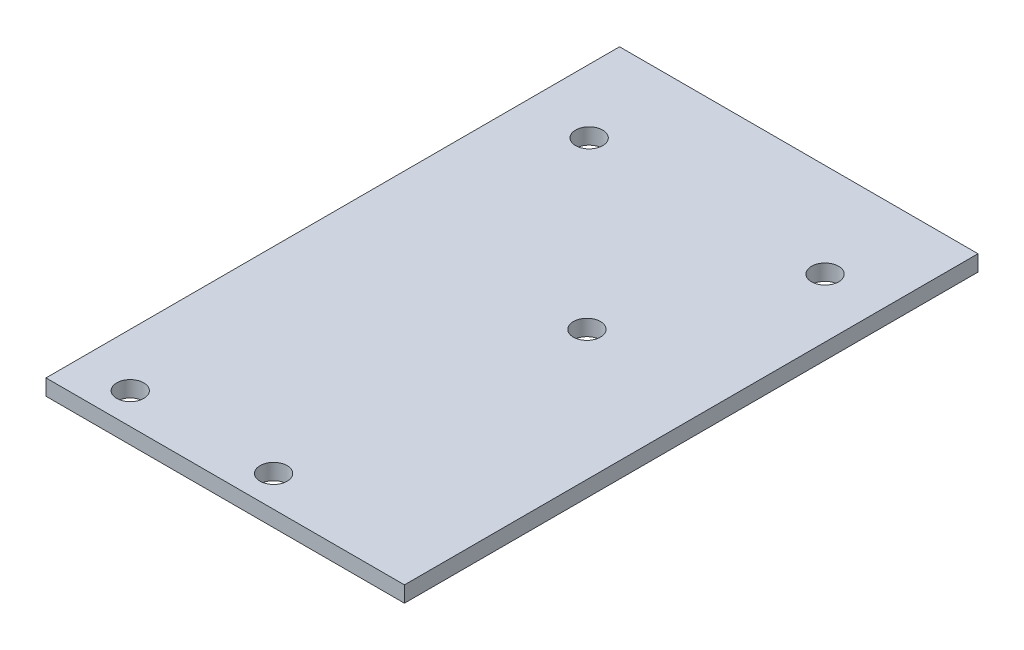
ISO-10303-21;
HEADER;
FILE_DESCRIPTION(('STEP AP214'),'2;1');
FILE_NAME('part.step','',(''),(''),'','','');
FILE_SCHEMA(('AUTOMOTIVE_DESIGN { 1 0 10303 214 1 1 1 1 }'));
ENDSEC;
DATA;
#1=APPLICATION_CONTEXT('core data for automotive mechanical design processes');
#2=APPLICATION_PROTOCOL_DEFINITION('international standard','automotive_design',2000,#1);
#3=PRODUCT_CONTEXT('',#1,'mechanical');
#4=PRODUCT('Part','Part','',(#3));
#5=PRODUCT_RELATED_PRODUCT_CATEGORY('part','',(#4));
#6=PRODUCT_DEFINITION_FORMATION('','',#4);
#7=PRODUCT_DEFINITION_CONTEXT('part definition',#1,'design');
#8=PRODUCT_DEFINITION('design','',#6,#7);
#9=PRODUCT_DEFINITION_SHAPE('','',#8);
#10=(LENGTH_UNIT() NAMED_UNIT(*) SI_UNIT(.MILLI.,.METRE.));
#11=(NAMED_UNIT(*) PLANE_ANGLE_UNIT() SI_UNIT($,.RADIAN.));
#12=(NAMED_UNIT(*) SI_UNIT($,.STERADIAN.) SOLID_ANGLE_UNIT());
#13=UNCERTAINTY_MEASURE_WITH_UNIT(LENGTH_MEASURE(1.E-05),#10,'distance_accuracy_value','');
#14=(GEOMETRIC_REPRESENTATION_CONTEXT(3) GLOBAL_UNCERTAINTY_ASSIGNED_CONTEXT((#13)) GLOBAL_UNIT_ASSIGNED_CONTEXT((#10,
#11,#12)) REPRESENTATION_CONTEXT('',''));
#15=CARTESIAN_POINT('',(0.,0.,0.));
#16=DIRECTION('',(0.,0.,1.));
#17=DIRECTION('',(1.,0.,0.));
#18=AXIS2_PLACEMENT_3D('',#15,#16,#17);
#19=CARTESIAN_POINT('',(-22.5,-2.,36.));
#20=DIRECTION('',(-1.,0.,0.));
#21=DIRECTION('',(0.,0.,1.));
#22=AXIS2_PLACEMENT_3D('',#19,#20,#21);
#23=PLANE('',#22);
#24=DIRECTION('',(0.,0.,1.));
#25=VECTOR('',#24,1.);
#26=CARTESIAN_POINT('',(-22.5,0.,36.));
#27=LINE('',#26,#25);
#28=CARTESIAN_POINT('',(-22.5,0.,-36.));
#29=VERTEX_POINT('',#28);
#30=CARTESIAN_POINT('',(-22.5,0.,36.));
#31=VERTEX_POINT('',#30);
#32=EDGE_CURVE('E104',#29,#31,#27,.T.);
#33=ORIENTED_EDGE('',*,*,#32,.F.);
#34=DIRECTION('',(0.,1.,0.));
#35=VECTOR('',#34,1.);
#36=CARTESIAN_POINT('',(-22.5,-2.,-36.));
#37=LINE('',#36,#35);
#38=CARTESIAN_POINT('',(-22.5,-2.,-36.));
#39=VERTEX_POINT('',#38);
#40=EDGE_CURVE('E11',#39,#29,#37,.T.);
#41=ORIENTED_EDGE('',*,*,#40,.F.);
#42=DIRECTION('',(0.,0.,1.));
#43=VECTOR('',#42,1.);
#44=CARTESIAN_POINT('',(-22.5,-2.,36.));
#45=LINE('',#44,#43);
#46=CARTESIAN_POINT('',(-22.5,-2.,36.));
#47=VERTEX_POINT('',#46);
#48=EDGE_CURVE('E97',#39,#47,#45,.T.);
#49=ORIENTED_EDGE('',*,*,#48,.T.);
#50=DIRECTION('',(0.,1.,0.));
#51=VECTOR('',#50,1.);
#52=CARTESIAN_POINT('',(-22.5,-2.,36.));
#53=LINE('',#52,#51);
#54=EDGE_CURVE('E80',#47,#31,#53,.T.);
#55=ORIENTED_EDGE('',*,*,#54,.T.);
#56=EDGE_LOOP('',(#33,#41,#49,#55));
#57=FACE_BOUND('',#56,.T.);
#58=ADVANCED_FACE('F37',(#57),#23,.T.);
#59=CARTESIAN_POINT('',(22.5,-2.,-36.));
#60=DIRECTION('',(0.,0.,-1.));
#61=DIRECTION('',(-1.,0.,0.));
#62=AXIS2_PLACEMENT_3D('',#59,#60,#61);
#63=PLANE('',#62);
#64=DIRECTION('',(-1.,0.,0.));
#65=VECTOR('',#64,1.);
#66=CARTESIAN_POINT('',(22.5,0.,-36.));
#67=LINE('',#66,#65);
#68=CARTESIAN_POINT('',(22.5,0.,-36.));
#69=VERTEX_POINT('',#68);
#70=EDGE_CURVE('E99',#69,#29,#67,.T.);
#71=ORIENTED_EDGE('',*,*,#70,.F.);
#72=DIRECTION('',(0.,1.,0.));
#73=VECTOR('',#72,1.);
#74=CARTESIAN_POINT('',(22.5,-2.,-36.));
#75=LINE('',#74,#73);
#76=CARTESIAN_POINT('',(22.5,-2.,-36.));
#77=VERTEX_POINT('',#76);
#78=EDGE_CURVE('E46',#77,#69,#75,.T.);
#79=ORIENTED_EDGE('',*,*,#78,.F.);
#80=DIRECTION('',(-1.,0.,0.));
#81=VECTOR('',#80,1.);
#82=CARTESIAN_POINT('',(22.5,-2.,-36.));
#83=LINE('',#82,#81);
#84=EDGE_CURVE('E94',#77,#39,#83,.T.);
#85=ORIENTED_EDGE('',*,*,#84,.T.);
#86=ORIENTED_EDGE('',*,*,#40,.T.);
#87=EDGE_LOOP('',(#71,#79,#85,#86));
#88=FACE_BOUND('',#87,.T.);
#89=ADVANCED_FACE('F148',(#88),#63,.T.);
#90=CARTESIAN_POINT('',(22.5,-2.,36.));
#91=DIRECTION('',(1.,0.,0.));
#92=DIRECTION('',(0.,0.,-1.));
#93=AXIS2_PLACEMENT_3D('',#90,#91,#92);
#94=PLANE('',#93);
#95=DIRECTION('',(0.,0.,-1.));
#96=VECTOR('',#95,1.);
#97=CARTESIAN_POINT('',(22.5,0.,36.));
#98=LINE('',#97,#96);
#99=CARTESIAN_POINT('',(22.5,0.,36.));
#100=VERTEX_POINT('',#99);
#101=EDGE_CURVE('E88',#100,#69,#98,.T.);
#102=ORIENTED_EDGE('',*,*,#101,.F.);
#103=DIRECTION('',(0.,1.,0.));
#104=VECTOR('',#103,1.);
#105=CARTESIAN_POINT('',(22.5,-2.,36.));
#106=LINE('',#105,#104);
#107=CARTESIAN_POINT('',(22.5,-2.,36.));
#108=VERTEX_POINT('',#107);
#109=EDGE_CURVE('E83',#108,#100,#106,.T.);
#110=ORIENTED_EDGE('',*,*,#109,.F.);
#111=DIRECTION('',(0.,0.,-1.));
#112=VECTOR('',#111,1.);
#113=CARTESIAN_POINT('',(22.5,-2.,36.));
#114=LINE('',#113,#112);
#115=EDGE_CURVE('E86',#108,#77,#114,.T.);
#116=ORIENTED_EDGE('',*,*,#115,.T.);
#117=ORIENTED_EDGE('',*,*,#78,.T.);
#118=EDGE_LOOP('',(#102,#110,#116,#117));
#119=FACE_BOUND('',#118,.T.);
#120=ADVANCED_FACE('F85',(#119),#94,.T.);
#121=CARTESIAN_POINT('',(22.5,-2.,36.));
#122=DIRECTION('',(0.,0.,1.));
#123=DIRECTION('',(1.,0.,0.));
#124=AXIS2_PLACEMENT_3D('',#121,#122,#123);
#125=PLANE('',#124);
#126=DIRECTION('',(1.,0.,0.));
#127=VECTOR('',#126,1.);
#128=CARTESIAN_POINT('',(22.5,0.,36.));
#129=LINE('',#128,#127);
#130=EDGE_CURVE('E107',#31,#100,#129,.T.);
#131=ORIENTED_EDGE('',*,*,#130,.F.);
#132=ORIENTED_EDGE('',*,*,#54,.F.);
#133=DIRECTION('',(1.,0.,0.));
#134=VECTOR('',#133,1.);
#135=CARTESIAN_POINT('',(22.5,-2.,36.));
#136=LINE('',#135,#134);
#137=EDGE_CURVE('E93',#47,#108,#136,.T.);
#138=ORIENTED_EDGE('',*,*,#137,.T.);
#139=ORIENTED_EDGE('',*,*,#109,.T.);
#140=EDGE_LOOP('',(#131,#132,#138,#139));
#141=FACE_BOUND('',#140,.T.);
#142=ADVANCED_FACE('F96',(#141),#125,.T.);
#143=CARTESIAN_POINT('',(0.,-2.,0.));
#144=DIRECTION('',(0.,1.,0.));
#145=DIRECTION('',(0.,0.,1.));
#146=AXIS2_PLACEMENT_3D('',#143,#144,#145);
#147=PLANE('',#146);
#148=CARTESIAN_POINT('',(2.17232157779291,-2.,32.098));
#149=DIRECTION('',(0.,-1.,0.));
#150=DIRECTION('',(0.,0.,-1.));
#151=AXIS2_PLACEMENT_3D('',#148,#149,#150);
#152=CIRCLE('',#151,1.69999999999999);
#153=CARTESIAN_POINT('',(2.17232157779291,-2.,30.398));
#154=VERTEX_POINT('',#153);
#155=EDGE_CURVE('E189',#154,#154,#152,.T.);
#156=ORIENTED_EDGE('',*,*,#155,.F.);
#157=EDGE_LOOP('',(#156));
#158=FACE_BOUND('',#157,.T.);
#159=CARTESIAN_POINT('',(-15.8276784222071,-2.,32.098));
#160=DIRECTION('',(0.,-1.,0.));
#161=DIRECTION('',(0.,0.,-1.));
#162=AXIS2_PLACEMENT_3D('',#159,#160,#161);
#163=CIRCLE('',#162,1.69999999999999);
#164=CARTESIAN_POINT('',(-15.8276784222071,-2.,30.398));
#165=VERTEX_POINT('',#164);
#166=EDGE_CURVE('E132',#165,#165,#163,.T.);
#167=ORIENTED_EDGE('',*,*,#166,.F.);
#168=EDGE_LOOP('',(#167));
#169=FACE_BOUND('',#168,.T.);
#170=CARTESIAN_POINT('',(6.1723215777929,-2.,-3.23000000000001));
#171=DIRECTION('',(0.,-1.,0.));
#172=DIRECTION('',(0.,0.,-1.));
#173=AXIS2_PLACEMENT_3D('',#170,#171,#172);
#174=CIRCLE('',#173,1.69999999999999);
#175=CARTESIAN_POINT('',(6.1723215777929,-2.,-4.93));
#176=VERTEX_POINT('',#175);
#177=EDGE_CURVE('E121',#176,#176,#174,.T.);
#178=ORIENTED_EDGE('',*,*,#177,.F.);
#179=EDGE_LOOP('',(#178));
#180=FACE_BOUND('',#179,.T.);
#181=CARTESIAN_POINT('',(15.1096317147363,-2.,-24.190770957464));
#182=DIRECTION('',(0.,-1.,0.));
#183=DIRECTION('',(0.,0.,-1.));
#184=AXIS2_PLACEMENT_3D('',#181,#182,#183);
#185=CIRCLE('',#184,1.69999999999999);
#186=CARTESIAN_POINT('',(15.1096317147363,-2.,-25.890770957464));
#187=VERTEX_POINT('',#186);
#188=EDGE_CURVE('E118',#187,#187,#185,.T.);
#189=ORIENTED_EDGE('',*,*,#188,.F.);
#190=EDGE_LOOP('',(#189));
#191=FACE_BOUND('',#190,.T.);
#192=CARTESIAN_POINT('',(-14.5043161446878,-2.,-24.190770957464));
#193=DIRECTION('',(0.,-1.,0.));
#194=DIRECTION('',(0.,0.,-1.));
#195=AXIS2_PLACEMENT_3D('',#192,#193,#194);
#196=CIRCLE('',#195,1.69999999999999);
#197=CARTESIAN_POINT('',(-14.5043161446878,-2.,-25.890770957464));
#198=VERTEX_POINT('',#197);
#199=EDGE_CURVE('E117',#198,#198,#196,.T.);
#200=ORIENTED_EDGE('',*,*,#199,.F.);
#201=EDGE_LOOP('',(#200));
#202=FACE_BOUND('',#201,.T.);
#203=ORIENTED_EDGE('',*,*,#48,.F.);
#204=ORIENTED_EDGE('',*,*,#84,.F.);
#205=ORIENTED_EDGE('',*,*,#115,.F.);
#206=ORIENTED_EDGE('',*,*,#137,.F.);
#207=EDGE_LOOP('',(#203,#204,#205,#206));
#208=FACE_BOUND('',#207,.T.);
#209=ADVANCED_FACE('F92',(#158,#169,#180,#191,#202,#208),#147,.F.);
#210=CARTESIAN_POINT('',(0.,0.,0.));
#211=DIRECTION('',(0.,1.,0.));
#212=DIRECTION('',(0.,0.,1.));
#213=AXIS2_PLACEMENT_3D('',#210,#211,#212);
#214=PLANE('',#213);
#215=CARTESIAN_POINT('',(2.17232157779291,0.,32.098));
#216=DIRECTION('',(0.,1.,0.));
#217=DIRECTION('',(0.,0.,1.));
#218=AXIS2_PLACEMENT_3D('',#215,#216,#217);
#219=CIRCLE('',#218,1.69999999999999);
#220=CARTESIAN_POINT('',(2.17232157779291,0.,33.798));
#221=VERTEX_POINT('',#220);
#222=EDGE_CURVE('E40',#221,#221,#219,.T.);
#223=ORIENTED_EDGE('',*,*,#222,.F.);
#224=EDGE_LOOP('',(#223));
#225=FACE_BOUND('',#224,.T.);
#226=CARTESIAN_POINT('',(-15.8276784222071,0.,32.098));
#227=DIRECTION('',(0.,1.,0.));
#228=DIRECTION('',(0.,0.,1.));
#229=AXIS2_PLACEMENT_3D('',#226,#227,#228);
#230=CIRCLE('',#229,1.69999999999999);
#231=CARTESIAN_POINT('',(-15.8276784222071,0.,33.798));
#232=VERTEX_POINT('',#231);
#233=EDGE_CURVE('E127',#232,#232,#230,.T.);
#234=ORIENTED_EDGE('',*,*,#233,.F.);
#235=EDGE_LOOP('',(#234));
#236=FACE_BOUND('',#235,.T.);
#237=CARTESIAN_POINT('',(6.1723215777929,0.,-3.23000000000001));
#238=DIRECTION('',(0.,1.,0.));
#239=DIRECTION('',(0.,0.,1.));
#240=AXIS2_PLACEMENT_3D('',#237,#238,#239);
#241=CIRCLE('',#240,1.69999999999999);
#242=CARTESIAN_POINT('',(6.1723215777929,0.,-1.53000000000002));
#243=VERTEX_POINT('',#242);
#244=EDGE_CURVE('E119',#243,#243,#241,.T.);
#245=ORIENTED_EDGE('',*,*,#244,.F.);
#246=EDGE_LOOP('',(#245));
#247=FACE_BOUND('',#246,.T.);
#248=CARTESIAN_POINT('',(15.1096317147363,0.,-24.190770957464));
#249=DIRECTION('',(0.,1.,0.));
#250=DIRECTION('',(0.,0.,1.));
#251=AXIS2_PLACEMENT_3D('',#248,#249,#250);
#252=CIRCLE('',#251,1.69999999999999);
#253=CARTESIAN_POINT('',(15.1096317147363,0.,-22.490770957464));
#254=VERTEX_POINT('',#253);
#255=EDGE_CURVE('E115',#254,#254,#252,.T.);
#256=ORIENTED_EDGE('',*,*,#255,.F.);
#257=EDGE_LOOP('',(#256));
#258=FACE_BOUND('',#257,.T.);
#259=CARTESIAN_POINT('',(-14.5043161446878,0.,-24.190770957464));
#260=DIRECTION('',(0.,1.,0.));
#261=DIRECTION('',(0.,0.,1.));
#262=AXIS2_PLACEMENT_3D('',#259,#260,#261);
#263=CIRCLE('',#262,1.69999999999999);
#264=CARTESIAN_POINT('',(-14.5043161446878,0.,-22.490770957464));
#265=VERTEX_POINT('',#264);
#266=EDGE_CURVE('E108',#265,#265,#263,.T.);
#267=ORIENTED_EDGE('',*,*,#266,.F.);
#268=EDGE_LOOP('',(#267));
#269=FACE_BOUND('',#268,.T.);
#270=ORIENTED_EDGE('',*,*,#32,.T.);
#271=ORIENTED_EDGE('',*,*,#130,.T.);
#272=ORIENTED_EDGE('',*,*,#101,.T.);
#273=ORIENTED_EDGE('',*,*,#70,.T.);
#274=EDGE_LOOP('',(#270,#271,#272,#273));
#275=FACE_BOUND('',#274,.T.);
#276=ADVANCED_FACE('F143',(#225,#236,#247,#258,#269,#275),#214,.T.);
#277=CARTESIAN_POINT('',(-14.5043161446878,-2.,-24.190770957464));
#278=DIRECTION('',(0.,-1.,0.));
#279=DIRECTION('',(0.,0.,-1.));
#280=AXIS2_PLACEMENT_3D('',#277,#278,#279);
#281=CYLINDRICAL_SURFACE('',#280,1.69999999999999);
#282=ORIENTED_EDGE('',*,*,#266,.T.);
#283=EDGE_LOOP('',(#282));
#284=FACE_BOUND('',#283,.T.);
#285=ORIENTED_EDGE('',*,*,#199,.T.);
#286=EDGE_LOOP('',(#285));
#287=FACE_BOUND('',#286,.T.);
#288=ADVANCED_FACE('F140',(#284,#287),#281,.F.);
#289=CARTESIAN_POINT('',(15.1096317147363,-2.,-24.190770957464));
#290=DIRECTION('',(0.,-1.,0.));
#291=DIRECTION('',(0.,0.,-1.));
#292=AXIS2_PLACEMENT_3D('',#289,#290,#291);
#293=CYLINDRICAL_SURFACE('',#292,1.69999999999999);
#294=ORIENTED_EDGE('',*,*,#255,.T.);
#295=EDGE_LOOP('',(#294));
#296=FACE_BOUND('',#295,.T.);
#297=ORIENTED_EDGE('',*,*,#188,.T.);
#298=EDGE_LOOP('',(#297));
#299=FACE_BOUND('',#298,.T.);
#300=ADVANCED_FACE('F169',(#296,#299),#293,.F.);
#301=CARTESIAN_POINT('',(6.1723215777929,-2.,-3.23000000000001));
#302=DIRECTION('',(0.,-1.,0.));
#303=DIRECTION('',(0.,0.,-1.));
#304=AXIS2_PLACEMENT_3D('',#301,#302,#303);
#305=CYLINDRICAL_SURFACE('',#304,1.69999999999999);
#306=ORIENTED_EDGE('',*,*,#244,.T.);
#307=EDGE_LOOP('',(#306));
#308=FACE_BOUND('',#307,.T.);
#309=ORIENTED_EDGE('',*,*,#177,.T.);
#310=EDGE_LOOP('',(#309));
#311=FACE_BOUND('',#310,.T.);
#312=ADVANCED_FACE('F172',(#308,#311),#305,.F.);
#313=CARTESIAN_POINT('',(-15.8276784222071,-2.,32.098));
#314=DIRECTION('',(0.,-1.,0.));
#315=DIRECTION('',(0.,0.,-1.));
#316=AXIS2_PLACEMENT_3D('',#313,#314,#315);
#317=CYLINDRICAL_SURFACE('',#316,1.69999999999999);
#318=ORIENTED_EDGE('',*,*,#233,.T.);
#319=EDGE_LOOP('',(#318));
#320=FACE_BOUND('',#319,.T.);
#321=ORIENTED_EDGE('',*,*,#166,.T.);
#322=EDGE_LOOP('',(#321));
#323=FACE_BOUND('',#322,.T.);
#324=ADVANCED_FACE('F176',(#320,#323),#317,.F.);
#325=CARTESIAN_POINT('',(2.17232157779291,-2.,32.098));
#326=DIRECTION('',(0.,-1.,0.));
#327=DIRECTION('',(0.,0.,-1.));
#328=AXIS2_PLACEMENT_3D('',#325,#326,#327);
#329=CYLINDRICAL_SURFACE('',#328,1.69999999999999);
#330=ORIENTED_EDGE('',*,*,#222,.T.);
#331=EDGE_LOOP('',(#330));
#332=FACE_BOUND('',#331,.T.);
#333=ORIENTED_EDGE('',*,*,#155,.T.);
#334=EDGE_LOOP('',(#333));
#335=FACE_BOUND('',#334,.T.);
#336=ADVANCED_FACE('F179',(#332,#335),#329,.F.);
#337=CLOSED_SHELL('',(#58,#89,#120,#142,#209,#276,#288,#300,#312,#324,#336));
#338=MANIFOLD_SOLID_BREP('B2',#337);
#339=ADVANCED_BREP_SHAPE_REPRESENTATION('',(#18,#338),#14);
#340=SHAPE_DEFINITION_REPRESENTATION(#9,#339);
ENDSEC;
END-ISO-10303-21;
